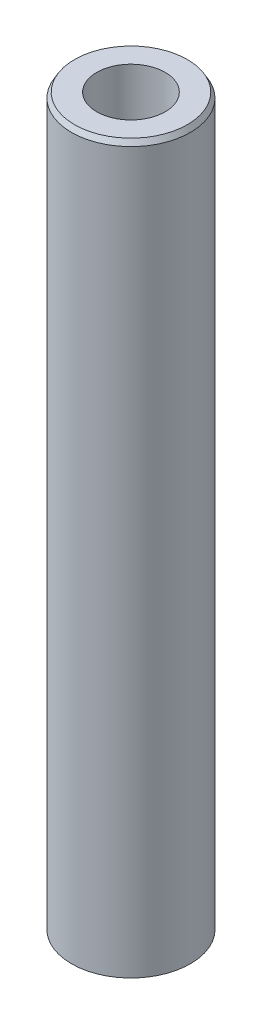
ISO-10303-21;
HEADER;
FILE_DESCRIPTION(('STEP AP214'),'2;1');
FILE_NAME('part.step','',(''),(''),'','','');
FILE_SCHEMA(('AUTOMOTIVE_DESIGN { 1 0 10303 214 1 1 1 1 }'));
ENDSEC;
DATA;
#1=APPLICATION_CONTEXT('core data for automotive mechanical design processes');
#2=APPLICATION_PROTOCOL_DEFINITION('international standard','automotive_design',2000,#1);
#3=PRODUCT_CONTEXT('',#1,'mechanical');
#4=PRODUCT('Part','Part','',(#3));
#5=PRODUCT_RELATED_PRODUCT_CATEGORY('part','',(#4));
#6=PRODUCT_DEFINITION_FORMATION('','',#4);
#7=PRODUCT_DEFINITION_CONTEXT('part definition',#1,'design');
#8=PRODUCT_DEFINITION('design','',#6,#7);
#9=PRODUCT_DEFINITION_SHAPE('','',#8);
#10=(LENGTH_UNIT() NAMED_UNIT(*) SI_UNIT(.MILLI.,.METRE.));
#11=(NAMED_UNIT(*) PLANE_ANGLE_UNIT() SI_UNIT($,.RADIAN.));
#12=(NAMED_UNIT(*) SI_UNIT($,.STERADIAN.) SOLID_ANGLE_UNIT());
#13=UNCERTAINTY_MEASURE_WITH_UNIT(LENGTH_MEASURE(1.E-05),#10,'distance_accuracy_value','');
#14=(GEOMETRIC_REPRESENTATION_CONTEXT(3) GLOBAL_UNCERTAINTY_ASSIGNED_CONTEXT((#13)) GLOBAL_UNIT_ASSIGNED_CONTEXT((#10,
#11,#12)) REPRESENTATION_CONTEXT('',''));
#15=CARTESIAN_POINT('',(0.,0.,0.));
#16=DIRECTION('',(0.,0.,1.));
#17=DIRECTION('',(1.,0.,0.));
#18=AXIS2_PLACEMENT_3D('',#15,#16,#17);
#19=CARTESIAN_POINT('',(0.,183.721375715341,0.));
#20=DIRECTION('',(0.,-1.,0.));
#21=DIRECTION('',(0.,0.,-1.));
#22=AXIS2_PLACEMENT_3D('',#19,#20,#21);
#23=CYLINDRICAL_SURFACE('',#22,15.);
#24=CARTESIAN_POINT('',(0.,182.406291833377,0.));
#25=DIRECTION('',(0.,1.,0.));
#26=DIRECTION('',(0.,0.,1.));
#27=AXIS2_PLACEMENT_3D('',#24,#25,#26);
#28=CIRCLE('',#27,15.);
#29=CARTESIAN_POINT('',(0.,182.406291833377,15.));
#30=VERTEX_POINT('',#29);
#31=EDGE_CURVE('E50',#30,#30,#28,.F.);
#32=ORIENTED_EDGE('',*,*,#31,.T.);
#33=EDGE_LOOP('',(#32));
#34=FACE_BOUND('',#33,.T.);
#35=CARTESIAN_POINT('',(0.,0.759264033258933,0.));
#36=DIRECTION('',(0.,1.,0.));
#37=DIRECTION('',(0.,0.,1.));
#38=AXIS2_PLACEMENT_3D('',#35,#36,#37);
#39=CIRCLE('',#38,15.);
#40=CARTESIAN_POINT('',(0.,0.759264033258933,15.));
#41=VERTEX_POINT('',#40);
#42=EDGE_CURVE('E51',#41,#41,#39,.T.);
#43=ORIENTED_EDGE('',*,*,#42,.T.);
#44=EDGE_LOOP('',(#43));
#45=FACE_BOUND('',#44,.T.);
#46=ADVANCED_FACE('F39',(#34,#45),#23,.T.);
#47=CARTESIAN_POINT('',(0.,183.721375715341,0.));
#48=DIRECTION('',(0.,1.,0.));
#49=DIRECTION('',(0.,0.,1.));
#50=AXIS2_PLACEMENT_3D('',#47,#48,#49);
#51=PLANE('',#50);
#52=CARTESIAN_POINT('',(0.,183.721375715341,0.));
#53=DIRECTION('',(0.,1.,0.));
#54=DIRECTION('',(0.,0.,1.));
#55=AXIS2_PLACEMENT_3D('',#52,#53,#54);
#56=CIRCLE('',#55,14.240735966741);
#57=CARTESIAN_POINT('',(0.,183.721375715341,14.240735966741));
#58=VERTEX_POINT('',#57);
#59=EDGE_CURVE('E54',#58,#58,#56,.T.);
#60=ORIENTED_EDGE('',*,*,#59,.T.);
#61=EDGE_LOOP('',(#60));
#62=FACE_BOUND('',#61,.T.);
#63=CARTESIAN_POINT('',(0.,183.721375715341,0.));
#64=DIRECTION('',(0.,1.,0.));
#65=DIRECTION('',(0.,0.,1.));
#66=AXIS2_PLACEMENT_3D('',#63,#64,#65);
#67=CIRCLE('',#66,8.62883207474967);
#68=CARTESIAN_POINT('',(0.,183.721375715341,8.62883207474967));
#69=VERTEX_POINT('',#68);
#70=EDGE_CURVE('E58',#69,#69,#67,.T.);
#71=ORIENTED_EDGE('',*,*,#70,.F.);
#72=EDGE_LOOP('',(#71));
#73=FACE_BOUND('',#72,.T.);
#74=ADVANCED_FACE('F69',(#62,#73),#51,.T.);
#75=CARTESIAN_POINT('',(0.,0.,0.));
#76=DIRECTION('',(0.,1.,0.));
#77=DIRECTION('',(0.,0.,1.));
#78=AXIS2_PLACEMENT_3D('',#75,#76,#77);
#79=PLANE('',#78);
#80=CARTESIAN_POINT('',(0.,0.,0.));
#81=DIRECTION('',(0.,1.,0.));
#82=DIRECTION('',(0.,0.,1.));
#83=AXIS2_PLACEMENT_3D('',#80,#81,#82);
#84=CIRCLE('',#83,13.6849161180358);
#85=CARTESIAN_POINT('',(0.,0.,13.6849161180358));
#86=VERTEX_POINT('',#85);
#87=EDGE_CURVE('E10',#86,#86,#84,.F.);
#88=ORIENTED_EDGE('',*,*,#87,.T.);
#89=EDGE_LOOP('',(#88));
#90=FACE_BOUND('',#89,.T.);
#91=CARTESIAN_POINT('',(0.,0.,0.));
#92=DIRECTION('',(0.,1.,0.));
#93=DIRECTION('',(0.,0.,1.));
#94=AXIS2_PLACEMENT_3D('',#91,#92,#93);
#95=CIRCLE('',#94,8.62883207474967);
#96=CARTESIAN_POINT('',(0.,0.,8.62883207474967));
#97=VERTEX_POINT('',#96);
#98=EDGE_CURVE('E63',#97,#97,#95,.T.);
#99=ORIENTED_EDGE('',*,*,#98,.T.);
#100=EDGE_LOOP('',(#99));
#101=FACE_BOUND('',#100,.T.);
#102=ADVANCED_FACE('F75',(#90,#101),#79,.F.);
#103=CARTESIAN_POINT('',(0.,183.721375715341,0.));
#104=DIRECTION('',(0.,-1.,0.));
#105=DIRECTION('',(0.,0.,-1.));
#106=AXIS2_PLACEMENT_3D('',#103,#104,#105);
#107=CYLINDRICAL_SURFACE('',#106,8.62883207474967);
#108=ORIENTED_EDGE('',*,*,#70,.T.);
#109=EDGE_LOOP('',(#108));
#110=FACE_BOUND('',#109,.T.);
#111=ORIENTED_EDGE('',*,*,#98,.F.);
#112=EDGE_LOOP('',(#111));
#113=FACE_BOUND('',#112,.T.);
#114=ADVANCED_FACE('F70',(#110,#113),#107,.F.);
#115=CARTESIAN_POINT('',(0.,183.721375715341,0.));
#116=DIRECTION('',(0.,-1.,0.));
#117=DIRECTION('',(0.,0.,-1.));
#118=AXIS2_PLACEMENT_3D('',#115,#116,#117);
#119=CONICAL_SURFACE('',#118,14.240735966741,0.523598775598295);
#120=ORIENTED_EDGE('',*,*,#31,.F.);
#121=EDGE_LOOP('',(#120));
#122=FACE_BOUND('',#121,.T.);
#123=ORIENTED_EDGE('',*,*,#59,.F.);
#124=EDGE_LOOP('',(#123));
#125=FACE_BOUND('',#124,.T.);
#126=ADVANCED_FACE('F81',(#122,#125),#119,.T.);
#127=CARTESIAN_POINT('',(0.,0.759264033258933,0.));
#128=DIRECTION('',(0.,1.,0.));
#129=DIRECTION('',(0.,0.,1.));
#130=AXIS2_PLACEMENT_3D('',#127,#128,#129);
#131=CONICAL_SURFACE('',#130,15.,1.04719755119662);
#132=ORIENTED_EDGE('',*,*,#87,.F.);
#133=EDGE_LOOP('',(#132));
#134=FACE_BOUND('',#133,.T.);
#135=ORIENTED_EDGE('',*,*,#42,.F.);
#136=EDGE_LOOP('',(#135));
#137=FACE_BOUND('',#136,.T.);
#138=ADVANCED_FACE('F45',(#134,#137),#131,.T.);
#139=CLOSED_SHELL('',(#46,#74,#102,#114,#126,#138));
#140=MANIFOLD_SOLID_BREP('B2',#139);
#141=ADVANCED_BREP_SHAPE_REPRESENTATION('',(#18,#140),#14);
#142=SHAPE_DEFINITION_REPRESENTATION(#9,#141);
ENDSEC;
END-ISO-10303-21;
